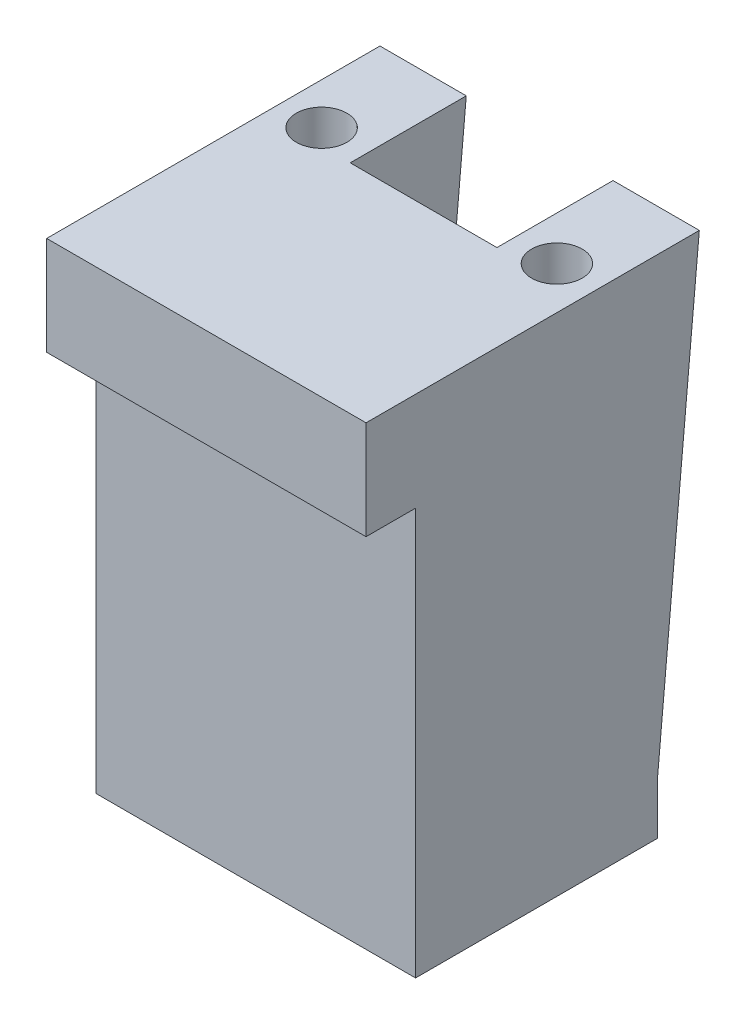
ISO-10303-21;
HEADER;
FILE_DESCRIPTION(('STEP AP214'),'2;1');
FILE_NAME('part.step','',(''),(''),'','','');
FILE_SCHEMA(('AUTOMOTIVE_DESIGN { 1 0 10303 214 1 1 1 1 }'));
ENDSEC;
DATA;
#1=APPLICATION_CONTEXT('core data for automotive mechanical design processes');
#2=APPLICATION_PROTOCOL_DEFINITION('international standard','automotive_design',2000,#1);
#3=PRODUCT_CONTEXT('',#1,'mechanical');
#4=PRODUCT('Part','Part','',(#3));
#5=PRODUCT_RELATED_PRODUCT_CATEGORY('part','',(#4));
#6=PRODUCT_DEFINITION_FORMATION('','',#4);
#7=PRODUCT_DEFINITION_CONTEXT('part definition',#1,'design');
#8=PRODUCT_DEFINITION('design','',#6,#7);
#9=PRODUCT_DEFINITION_SHAPE('','',#8);
#10=(LENGTH_UNIT() NAMED_UNIT(*) SI_UNIT(.MILLI.,.METRE.));
#11=(NAMED_UNIT(*) PLANE_ANGLE_UNIT() SI_UNIT($,.RADIAN.));
#12=(NAMED_UNIT(*) SI_UNIT($,.STERADIAN.) SOLID_ANGLE_UNIT());
#13=UNCERTAINTY_MEASURE_WITH_UNIT(LENGTH_MEASURE(1.E-05),#10,'distance_accuracy_value','');
#14=(GEOMETRIC_REPRESENTATION_CONTEXT(3) GLOBAL_UNCERTAINTY_ASSIGNED_CONTEXT((#13)) GLOBAL_UNIT_ASSIGNED_CONTEXT((#10,
#11,#12)) REPRESENTATION_CONTEXT('',''));
#15=CARTESIAN_POINT('',(0.,0.,0.));
#16=DIRECTION('',(0.,0.,1.));
#17=DIRECTION('',(1.,0.,0.));
#18=AXIS2_PLACEMENT_3D('',#15,#16,#17);
#19=CARTESIAN_POINT('',(9.55614021546639,122.000001788139,-106.221518242105));
#20=DIRECTION('',(0.,-1.,0.));
#21=DIRECTION('',(-1.,0.,0.));
#22=AXIS2_PLACEMENT_3D('',#19,#20,#21);
#23=CYLINDRICAL_SURFACE('',#22,2.05);
#24=CARTESIAN_POINT('',(9.55614021546639,122.000001788139,-106.221518242105));
#25=DIRECTION('',(0.,-1.,0.));
#26=DIRECTION('',(-1.,0.,0.));
#27=AXIS2_PLACEMENT_3D('',#24,#25,#26);
#28=CIRCLE('',#27,2.05);
#29=CARTESIAN_POINT('',(11.6061402154664,122.000001788139,-106.221518242105));
#30=VERTEX_POINT('',#29);
#31=EDGE_CURVE('E247',#30,#30,#28,.T.);
#32=ORIENTED_EDGE('',*,*,#31,.F.);
#33=DIRECTION('',(0.,-1.,0.));
#34=VECTOR('',#33,1.);
#35=CARTESIAN_POINT('',(11.6061402154664,122.000001788139,-106.221518242105));
#36=LINE('',#35,#34);
#37=CARTESIAN_POINT('',(11.6061402154664,111.000001788139,-106.221518242105));
#38=VERTEX_POINT('',#37);
#39=EDGE_CURVE('E11',#30,#38,#36,.T.);
#40=ORIENTED_EDGE('',*,*,#39,.T.);
#41=CARTESIAN_POINT('',(9.55614021546639,111.000001788139,-106.221518242105));
#42=DIRECTION('',(0.,-1.,0.));
#43=DIRECTION('',(-1.,0.,0.));
#44=AXIS2_PLACEMENT_3D('',#41,#42,#43);
#45=CIRCLE('',#44,2.05);
#46=EDGE_CURVE('E236',#38,#38,#45,.T.);
#47=ORIENTED_EDGE('',*,*,#46,.T.);
#48=ORIENTED_EDGE('',*,*,#39,.F.);
#49=EDGE_LOOP('',(#32,#40,#47,#48));
#50=FACE_BOUND('',#49,.T.);
#51=ADVANCED_FACE('F16',(#50),#23,.F.);
#52=CARTESIAN_POINT('',(-9.52534584156662,122.000001788139,-106.221518242105));
#53=DIRECTION('',(0.,-1.,0.));
#54=DIRECTION('',(-1.,0.,0.));
#55=AXIS2_PLACEMENT_3D('',#52,#53,#54);
#56=CYLINDRICAL_SURFACE('',#55,2.05);
#57=CARTESIAN_POINT('',(-9.52534584156662,122.000001788139,-106.221518242105));
#58=DIRECTION('',(0.,-1.,0.));
#59=DIRECTION('',(-1.,0.,0.));
#60=AXIS2_PLACEMENT_3D('',#57,#58,#59);
#61=CIRCLE('',#60,2.05);
#62=CARTESIAN_POINT('',(-7.47534584156661,122.000001788139,-106.221518242105));
#63=VERTEX_POINT('',#62);
#64=EDGE_CURVE('E251',#63,#63,#61,.T.);
#65=ORIENTED_EDGE('',*,*,#64,.F.);
#66=DIRECTION('',(0.,-1.,0.));
#67=VECTOR('',#66,1.);
#68=CARTESIAN_POINT('',(-7.47534584156661,122.000001788139,-106.221518242105));
#69=LINE('',#68,#67);
#70=CARTESIAN_POINT('',(-7.47534584156661,111.000001788139,-106.221518242105));
#71=VERTEX_POINT('',#70);
#72=EDGE_CURVE('E27',#63,#71,#69,.T.);
#73=ORIENTED_EDGE('',*,*,#72,.T.);
#74=CARTESIAN_POINT('',(-9.52534584156662,111.000001788139,-106.221518242105));
#75=DIRECTION('',(0.,-1.,0.));
#76=DIRECTION('',(-1.,0.,0.));
#77=AXIS2_PLACEMENT_3D('',#74,#75,#76);
#78=CIRCLE('',#77,2.05);
#79=EDGE_CURVE('E240',#71,#71,#78,.T.);
#80=ORIENTED_EDGE('',*,*,#79,.T.);
#81=ORIENTED_EDGE('',*,*,#72,.F.);
#82=EDGE_LOOP('',(#65,#73,#80,#81));
#83=FACE_BOUND('',#82,.T.);
#84=ADVANCED_FACE('F395',(#83),#56,.F.);
#85=CARTESIAN_POINT('',(13.0000001937151,142.,-149.000001152606));
#86=DIRECTION('',(1.,0.,0.));
#87=DIRECTION('',(0.,0.,-1.));
#88=AXIS2_PLACEMENT_3D('',#85,#86,#87);
#89=PLANE('',#88);
#90=DIRECTION('',(0.,0.995775852246426,-0.0918174933381671));
#91=VECTOR('',#90,1.);
#92=CARTESIAN_POINT('',(13.0000001937151,133.500726871943,-115.38831263984));
#93=LINE('',#92,#91);
#94=CARTESIAN_POINT('',(13.0000001937151,85.,-110.916206636852));
#95=VERTEX_POINT('',#94);
#96=CARTESIAN_POINT('',(13.0000001937151,122.000001788139,-114.32786540527));
#97=VERTEX_POINT('',#96);
#98=EDGE_CURVE('E239',#95,#97,#93,.T.);
#99=ORIENTED_EDGE('',*,*,#98,.T.);
#100=DIRECTION('',(0.,0.,-1.));
#101=VECTOR('',#100,1.);
#102=CARTESIAN_POINT('',(13.0000001937151,122.000001788139,-137.479052523667));
#103=LINE('',#102,#101);
#104=CARTESIAN_POINT('',(13.0000001937151,122.000001788139,-87.3002066368526));
#105=VERTEX_POINT('',#104);
#106=EDGE_CURVE('E197',#105,#97,#103,.T.);
#107=ORIENTED_EDGE('',*,*,#106,.F.);
#108=DIRECTION('',(0.,1.,0.));
#109=VECTOR('',#108,1.);
#110=CARTESIAN_POINT('',(13.0000001937151,142.,-87.3002066368526));
#111=LINE('',#110,#109);
#112=CARTESIAN_POINT('',(13.0000001937151,114.,-87.3002066368525));
#113=VERTEX_POINT('',#112);
#114=EDGE_CURVE('E148',#113,#105,#111,.T.);
#115=ORIENTED_EDGE('',*,*,#114,.F.);
#116=DIRECTION('',(0.,0.,1.));
#117=VECTOR('',#116,1.);
#118=CARTESIAN_POINT('',(13.0000001937151,114.,-102.916206636852));
#119=LINE('',#118,#117);
#120=CARTESIAN_POINT('',(13.0000001937151,114.,-91.3162066368525));
#121=VERTEX_POINT('',#120);
#122=EDGE_CURVE('E253',#121,#113,#119,.T.);
#123=ORIENTED_EDGE('',*,*,#122,.F.);
#124=DIRECTION('',(0.,1.,0.));
#125=VECTOR('',#124,1.);
#126=CARTESIAN_POINT('',(13.0000001937151,85.,-91.3162066368525));
#127=LINE('',#126,#125);
#128=CARTESIAN_POINT('',(13.0000001937151,81.,-91.3162066368525));
#129=VERTEX_POINT('',#128);
#130=EDGE_CURVE('E258',#129,#121,#127,.T.);
#131=ORIENTED_EDGE('',*,*,#130,.F.);
#132=DIRECTION('',(0.,0.,1.));
#133=VECTOR('',#132,1.);
#134=CARTESIAN_POINT('',(13.0000001937151,81.,-105.916206636852));
#135=LINE('',#134,#133);
#136=CARTESIAN_POINT('',(13.0000001937151,81.,-110.916206636852));
#137=VERTEX_POINT('',#136);
#138=EDGE_CURVE('E234',#137,#129,#135,.T.);
#139=ORIENTED_EDGE('',*,*,#138,.F.);
#140=DIRECTION('',(0.,-1.,0.));
#141=VECTOR('',#140,1.);
#142=CARTESIAN_POINT('',(13.0000001937151,85.,-110.916206636852));
#143=LINE('',#142,#141);
#144=EDGE_CURVE('E265',#95,#137,#143,.T.);
#145=ORIENTED_EDGE('',*,*,#144,.F.);
#146=EDGE_LOOP('',(#99,#107,#115,#123,#131,#139,#145));
#147=FACE_BOUND('',#146,.T.);
#148=ADVANCED_FACE('F336',(#147),#89,.T.);
#149=CARTESIAN_POINT('',(-12.8999816751176,142.,-102.916206636853));
#150=DIRECTION('',(-1.,0.,0.));
#151=DIRECTION('',(0.,1.,0.));
#152=AXIS2_PLACEMENT_3D('',#149,#150,#151);
#153=PLANE('',#152);
#154=DIRECTION('',(0.,-0.995775852246426,0.0918174933381671));
#155=VECTOR('',#154,1.);
#156=CARTESIAN_POINT('',(-12.8999816751176,131.394014438987,-115.194059029108));
#157=LINE('',#156,#155);
#158=CARTESIAN_POINT('',(-12.8999816751176,122.000001788139,-114.32786540527));
#159=VERTEX_POINT('',#158);
#160=CARTESIAN_POINT('',(-12.8999816751176,85.,-110.916206636852));
#161=VERTEX_POINT('',#160);
#162=EDGE_CURVE('E224',#159,#161,#157,.T.);
#163=ORIENTED_EDGE('',*,*,#162,.T.);
#164=DIRECTION('',(0.,-1.,0.));
#165=VECTOR('',#164,1.);
#166=CARTESIAN_POINT('',(-12.8999816751176,85.,-110.916206636852));
#167=LINE('',#166,#165);
#168=CARTESIAN_POINT('',(-12.8999816751176,81.,-110.916206636852));
#169=VERTEX_POINT('',#168);
#170=EDGE_CURVE('E146',#161,#169,#167,.T.);
#171=ORIENTED_EDGE('',*,*,#170,.T.);
#172=DIRECTION('',(0.,0.,1.));
#173=VECTOR('',#172,1.);
#174=CARTESIAN_POINT('',(-12.8999816751176,81.,-100.316206636852));
#175=LINE('',#174,#173);
#176=CARTESIAN_POINT('',(-12.8999816751176,81.,-91.3162066368525));
#177=VERTEX_POINT('',#176);
#178=EDGE_CURVE('E243',#169,#177,#175,.T.);
#179=ORIENTED_EDGE('',*,*,#178,.T.);
#180=DIRECTION('',(0.,-1.,0.));
#181=VECTOR('',#180,1.);
#182=CARTESIAN_POINT('',(-12.8999816751176,137.,-91.3162066368525));
#183=LINE('',#182,#181);
#184=CARTESIAN_POINT('',(-12.8999816751176,114.,-91.3162066368525));
#185=VERTEX_POINT('',#184);
#186=EDGE_CURVE('E229',#185,#177,#183,.T.);
#187=ORIENTED_EDGE('',*,*,#186,.F.);
#188=DIRECTION('',(0.,0.,1.));
#189=VECTOR('',#188,1.);
#190=CARTESIAN_POINT('',(-12.8999816751176,114.,-102.916206636852));
#191=LINE('',#190,#189);
#192=CARTESIAN_POINT('',(-12.8999816751176,114.,-87.3002066368525));
#193=VERTEX_POINT('',#192);
#194=EDGE_CURVE('E293',#185,#193,#191,.T.);
#195=ORIENTED_EDGE('',*,*,#194,.T.);
#196=DIRECTION('',(0.,-1.,0.));
#197=VECTOR('',#196,1.);
#198=CARTESIAN_POINT('',(-12.8999816751176,142.,-87.3002066368526));
#199=LINE('',#198,#197);
#200=CARTESIAN_POINT('',(-12.8999816751176,122.000001788139,-87.3002066368526));
#201=VERTEX_POINT('',#200);
#202=EDGE_CURVE('E155',#201,#193,#199,.T.);
#203=ORIENTED_EDGE('',*,*,#202,.F.);
#204=DIRECTION('',(0.,0.,1.));
#205=VECTOR('',#204,1.);
#206=CARTESIAN_POINT('',(-12.8999816751176,122.000001788139,-114.437155265791));
#207=LINE('',#206,#205);
#208=EDGE_CURVE('E190',#159,#201,#207,.T.);
#209=ORIENTED_EDGE('',*,*,#208,.F.);
#210=EDGE_LOOP('',(#163,#171,#179,#187,#195,#203,#209));
#211=FACE_BOUND('',#210,.T.);
#212=ADVANCED_FACE('F327',(#211),#153,.T.);
#213=CARTESIAN_POINT('',(-12.8999816751176,122.000001788139,-114.32786540527));
#214=DIRECTION('',(0.,0.0918174933381671,0.995775852246426));
#215=DIRECTION('',(1.,0.,0.));
#216=AXIS2_PLACEMENT_3D('',#213,#214,#215);
#217=PLANE('',#216);
#218=DIRECTION('',(1.,0.,0.));
#219=VECTOR('',#218,1.);
#220=CARTESIAN_POINT('',(-6.89998167511758,85.,-110.916206636852));
#221=LINE('',#220,#219);
#222=CARTESIAN_POINT('',(-5.89998167511758,84.9999999999955,-110.916206636852));
#223=VERTEX_POINT('',#222);
#224=EDGE_CURVE('E122',#161,#223,#221,.T.);
#225=ORIENTED_EDGE('',*,*,#224,.F.);
#226=ORIENTED_EDGE('',*,*,#162,.F.);
#227=DIRECTION('',(1.,0.,0.));
#228=VECTOR('',#227,1.);
#229=CARTESIAN_POINT('',(-6.90000008940697,122.000001788139,-114.32786540527));
#230=LINE('',#229,#228);
#231=CARTESIAN_POINT('',(-5.89998167511758,122.000001788139,-114.32786540527));
#232=VERTEX_POINT('',#231);
#233=EDGE_CURVE('E124',#159,#232,#230,.T.);
#234=ORIENTED_EDGE('',*,*,#233,.T.);
#235=DIRECTION('',(0.,0.995775852246426,-0.0918174933381668));
#236=VECTOR('',#235,1.);
#237=CARTESIAN_POINT('',(-5.89998167511758,85.0000000000004,-110.916206636853));
#238=LINE('',#237,#236);
#239=EDGE_CURVE('E20',#223,#232,#238,.T.);
#240=ORIENTED_EDGE('',*,*,#239,.F.);
#241=EDGE_LOOP('',(#225,#226,#234,#240));
#242=FACE_BOUND('',#241,.T.);
#243=ADVANCED_FACE('F120',(#242),#217,.F.);
#244=CARTESIAN_POINT('',(-12.8999816751176,122.000001788139,-114.32786540527));
#245=DIRECTION('',(0.,0.0918174933381671,0.995775852246426));
#246=DIRECTION('',(1.,0.,0.));
#247=AXIS2_PLACEMENT_3D('',#244,#245,#246);
#248=PLANE('',#247);
#249=DIRECTION('',(-1.,0.,0.));
#250=VECTOR('',#249,1.);
#251=CARTESIAN_POINT('',(7.00001832488242,122.000001788139,-114.32786540527));
#252=LINE('',#251,#250);
#253=CARTESIAN_POINT('',(6.00001832488242,122.000001788139,-114.32786540527));
#254=VERTEX_POINT('',#253);
#255=EDGE_CURVE('E252',#97,#254,#252,.T.);
#256=ORIENTED_EDGE('',*,*,#255,.F.);
#257=ORIENTED_EDGE('',*,*,#98,.F.);
#258=DIRECTION('',(1.,0.,0.));
#259=VECTOR('',#258,1.);
#260=CARTESIAN_POINT('',(13.0000001937151,85.,-110.916206636852));
#261=LINE('',#260,#259);
#262=CARTESIAN_POINT('',(6.00001832488242,85.,-110.916206636852));
#263=VERTEX_POINT('',#262);
#264=EDGE_CURVE('E217',#263,#95,#261,.T.);
#265=ORIENTED_EDGE('',*,*,#264,.F.);
#266=DIRECTION('',(0.,-0.995775852246426,0.0918174933381671));
#267=VECTOR('',#266,1.);
#268=CARTESIAN_POINT('',(6.00001832488242,121.543351970749,-114.285759100451));
#269=LINE('',#268,#267);
#270=EDGE_CURVE('E173',#254,#263,#269,.T.);
#271=ORIENTED_EDGE('',*,*,#270,.F.);
#272=EDGE_LOOP('',(#256,#257,#265,#271));
#273=FACE_BOUND('',#272,.T.);
#274=ADVANCED_FACE('F18',(#273),#248,.F.);
#275=CARTESIAN_POINT('',(9.55614021546639,111.000001788139,-106.221518242105));
#276=DIRECTION('',(0.,1.,0.));
#277=DIRECTION('',(1.,0.,0.));
#278=AXIS2_PLACEMENT_3D('',#275,#276,#277);
#279=PLANE('',#278);
#280=ORIENTED_EDGE('',*,*,#46,.F.);
#281=EDGE_LOOP('',(#280));
#282=FACE_BOUND('',#281,.T.);
#283=ADVANCED_FACE('F384',(#282),#279,.T.);
#284=CARTESIAN_POINT('',(-9.52534584156662,111.000001788139,-106.221518242105));
#285=DIRECTION('',(0.,1.,0.));
#286=DIRECTION('',(1.,0.,0.));
#287=AXIS2_PLACEMENT_3D('',#284,#285,#286);
#288=PLANE('',#287);
#289=ORIENTED_EDGE('',*,*,#79,.F.);
#290=EDGE_LOOP('',(#289));
#291=FACE_BOUND('',#290,.T.);
#292=ADVANCED_FACE('F390',(#291),#288,.T.);
#293=CARTESIAN_POINT('',(6.00000007450581,122.000001788139,-86.));
#294=DIRECTION('',(0.,-1.,0.));
#295=DIRECTION('',(0.,0.,-1.));
#296=AXIS2_PLACEMENT_3D('',#293,#294,#295);
#297=PLANE('',#296);
#298=ORIENTED_EDGE('',*,*,#64,.T.);
#299=EDGE_LOOP('',(#298));
#300=FACE_BOUND('',#299,.T.);
#301=ORIENTED_EDGE('',*,*,#31,.T.);
#302=EDGE_LOOP('',(#301));
#303=FACE_BOUND('',#302,.T.);
#304=DIRECTION('',(-1.,0.,0.));
#305=VECTOR('',#304,1.);
#306=CARTESIAN_POINT('',(-3.44999080030589,122.000001788139,-104.916206636853));
#307=LINE('',#306,#305);
#308=CARTESIAN_POINT('',(6.00000007450581,122.000001788139,-104.916206636853));
#309=VERTEX_POINT('',#308);
#310=CARTESIAN_POINT('',(-5.90000008940697,122.000001788139,-104.916206636853));
#311=VERTEX_POINT('',#310);
#312=EDGE_CURVE('E159',#309,#311,#307,.T.);
#313=ORIENTED_EDGE('',*,*,#312,.T.);
#314=DIRECTION('',(0.,0.,1.));
#315=VECTOR('',#314,1.);
#316=CARTESIAN_POINT('',(-5.89998167511758,122.000001788139,-98.4581033184263));
#317=LINE('',#316,#315);
#318=CARTESIAN_POINT('',(-5.89998167511758,122.000001788139,-110.916206636853));
#319=VERTEX_POINT('',#318);
#320=EDGE_CURVE('E182',#319,#311,#317,.T.);
#321=ORIENTED_EDGE('',*,*,#320,.F.);
#322=DIRECTION('',(0.,0.,1.));
#323=VECTOR('',#322,1.);
#324=CARTESIAN_POINT('',(-5.89998167511758,122.000001788139,-110.916206636853));
#325=LINE('',#324,#323);
#326=EDGE_CURVE('E128',#232,#319,#325,.T.);
#327=ORIENTED_EDGE('',*,*,#326,.F.);
#328=ORIENTED_EDGE('',*,*,#233,.F.);
#329=ORIENTED_EDGE('',*,*,#208,.T.);
#330=DIRECTION('',(-1.,0.,0.));
#331=VECTOR('',#330,1.);
#332=CARTESIAN_POINT('',(6.52501168851824,122.000001788139,-87.3002066368525));
#333=LINE('',#332,#331);
#334=EDGE_CURVE('E286',#105,#201,#333,.T.);
#335=ORIENTED_EDGE('',*,*,#334,.F.);
#336=ORIENTED_EDGE('',*,*,#106,.T.);
#337=ORIENTED_EDGE('',*,*,#255,.T.);
#338=DIRECTION('',(0.,0.,-1.));
#339=VECTOR('',#338,1.);
#340=CARTESIAN_POINT('',(6.00001832488242,122.000001788139,-100.591975971241));
#341=LINE('',#340,#339);
#342=CARTESIAN_POINT('',(6.00000007450581,122.000001788139,-110.916206636853));
#343=VERTEX_POINT('',#342);
#344=EDGE_CURVE('E191',#343,#254,#341,.T.);
#345=ORIENTED_EDGE('',*,*,#344,.F.);
#346=DIRECTION('',(0.,0.,-1.));
#347=VECTOR('',#346,1.);
#348=CARTESIAN_POINT('',(6.00001832488242,122.000001788139,-100.591975971241));
#349=LINE('',#348,#347);
#350=EDGE_CURVE('E200',#309,#343,#349,.T.);
#351=ORIENTED_EDGE('',*,*,#350,.F.);
#352=EDGE_LOOP('',(#313,#321,#327,#328,#329,#335,#336,#337,#345,#351));
#353=FACE_BOUND('',#352,.T.);
#354=ADVANCED_FACE('F324',(#300,#303,#353),#297,.F.);
#355=CARTESIAN_POINT('',(6.00001832488242,121.,-115.183951942483));
#356=DIRECTION('',(-1.,0.,0.));
#357=DIRECTION('',(0.,0.,1.));
#358=AXIS2_PLACEMENT_3D('',#355,#356,#357);
#359=PLANE('',#358);
#360=ORIENTED_EDGE('',*,*,#270,.T.);
#361=DIRECTION('',(0.,-1.,0.));
#362=VECTOR('',#361,1.);
#363=CARTESIAN_POINT('',(6.00001832488242,85.,-110.916206636852));
#364=LINE('',#363,#362);
#365=CARTESIAN_POINT('',(6.00001832488242,81.,-110.916206636852));
#366=VERTEX_POINT('',#365);
#367=EDGE_CURVE('E230',#263,#366,#364,.T.);
#368=ORIENTED_EDGE('',*,*,#367,.T.);
#369=DIRECTION('',(0.,0.,-1.));
#370=VECTOR('',#369,1.);
#371=CARTESIAN_POINT('',(6.00001832488242,81.,-111.800079289667));
#372=LINE('',#371,#370);
#373=CARTESIAN_POINT('',(6.00001832488242,81.,-104.916206636852));
#374=VERTEX_POINT('',#373);
#375=EDGE_CURVE('E187',#374,#366,#372,.T.);
#376=ORIENTED_EDGE('',*,*,#375,.F.);
#377=DIRECTION('',(0.,-1.,0.));
#378=VECTOR('',#377,1.);
#379=CARTESIAN_POINT('',(6.00001832488242,129.,-104.916206636853));
#380=LINE('',#379,#378);
#381=EDGE_CURVE('E164',#309,#374,#380,.T.);
#382=ORIENTED_EDGE('',*,*,#381,.F.);
#383=ORIENTED_EDGE('',*,*,#350,.T.);
#384=ORIENTED_EDGE('',*,*,#344,.T.);
#385=EDGE_LOOP('',(#360,#368,#376,#382,#383,#384));
#386=FACE_BOUND('',#385,.T.);
#387=ADVANCED_FACE('F378',(#386),#359,.T.);
#388=CARTESIAN_POINT('',(-12.8999816751176,137.,-104.916206636853));
#389=DIRECTION('',(0.,0.,1.));
#390=DIRECTION('',(1.,0.,0.));
#391=AXIS2_PLACEMENT_3D('',#388,#389,#390);
#392=PLANE('',#391);
#393=DIRECTION('',(0.,1.,0.));
#394=VECTOR('',#393,1.);
#395=CARTESIAN_POINT('',(-5.89998167511758,129.50000089407,-104.916206636853));
#396=LINE('',#395,#394);
#397=CARTESIAN_POINT('',(-5.89998167511758,81.,-104.916206636852));
#398=VERTEX_POINT('',#397);
#399=EDGE_CURVE('E129',#398,#311,#396,.T.);
#400=ORIENTED_EDGE('',*,*,#399,.T.);
#401=ORIENTED_EDGE('',*,*,#312,.F.);
#402=ORIENTED_EDGE('',*,*,#381,.T.);
#403=DIRECTION('',(1.,0.,0.));
#404=VECTOR('',#403,1.);
#405=CARTESIAN_POINT('',(3.02501379209059,81.,-104.916206636853));
#406=LINE('',#405,#404);
#407=EDGE_CURVE('E218',#398,#374,#406,.T.);
#408=ORIENTED_EDGE('',*,*,#407,.F.);
#409=EDGE_LOOP('',(#400,#401,#402,#408));
#410=FACE_BOUND('',#409,.T.);
#411=ADVANCED_FACE('F406',(#410),#392,.F.);
#412=CARTESIAN_POINT('',(-5.89998167511758,122.000001788139,-110.916206636853));
#413=DIRECTION('',(1.,0.,0.));
#414=DIRECTION('',(0.,1.,0.));
#415=AXIS2_PLACEMENT_3D('',#412,#413,#414);
#416=PLANE('',#415);
#417=ORIENTED_EDGE('',*,*,#320,.T.);
#418=ORIENTED_EDGE('',*,*,#399,.F.);
#419=DIRECTION('',(0.,0.,1.));
#420=VECTOR('',#419,1.);
#421=CARTESIAN_POINT('',(-5.89998167511758,81.,-109.666206636853));
#422=LINE('',#421,#420);
#423=CARTESIAN_POINT('',(-5.89998167511758,81.,-110.916206636852));
#424=VERTEX_POINT('',#423);
#425=EDGE_CURVE('E136',#424,#398,#422,.T.);
#426=ORIENTED_EDGE('',*,*,#425,.F.);
#427=DIRECTION('',(0.,-1.,0.));
#428=VECTOR('',#427,1.);
#429=CARTESIAN_POINT('',(-5.89998167511758,85.,-110.916206636852));
#430=LINE('',#429,#428);
#431=EDGE_CURVE('E131',#223,#424,#430,.T.);
#432=ORIENTED_EDGE('',*,*,#431,.F.);
#433=ORIENTED_EDGE('',*,*,#239,.T.);
#434=ORIENTED_EDGE('',*,*,#326,.T.);
#435=EDGE_LOOP('',(#417,#418,#426,#432,#433,#434));
#436=FACE_BOUND('',#435,.T.);
#437=ADVANCED_FACE('F133',(#436),#416,.T.);
#438=CARTESIAN_POINT('',(0.0500092592987578,81.,-108.416206636852));
#439=DIRECTION('',(0.,-1.,0.));
#440=DIRECTION('',(0.,0.,-1.));
#441=AXIS2_PLACEMENT_3D('',#438,#439,#440);
#442=PLANE('',#441);
#443=DIRECTION('',(1.,0.,0.));
#444=VECTOR('',#443,1.);
#445=CARTESIAN_POINT('',(13.0000001937151,81.,-110.916206636852));
#446=LINE('',#445,#444);
#447=EDGE_CURVE('E235',#366,#137,#446,.T.);
#448=ORIENTED_EDGE('',*,*,#447,.T.);
#449=ORIENTED_EDGE('',*,*,#138,.T.);
#450=DIRECTION('',(1.,0.,0.));
#451=VECTOR('',#450,1.);
#452=CARTESIAN_POINT('',(-12.8999816751176,81.,-91.3162066368525));
#453=LINE('',#452,#451);
#454=EDGE_CURVE('E272',#177,#129,#453,.T.);
#455=ORIENTED_EDGE('',*,*,#454,.F.);
#456=ORIENTED_EDGE('',*,*,#178,.F.);
#457=DIRECTION('',(1.,0.,0.));
#458=VECTOR('',#457,1.);
#459=CARTESIAN_POINT('',(-6.89998167511758,81.,-110.916206636852));
#460=LINE('',#459,#458);
#461=EDGE_CURVE('E141',#169,#424,#460,.T.);
#462=ORIENTED_EDGE('',*,*,#461,.T.);
#463=ORIENTED_EDGE('',*,*,#425,.T.);
#464=ORIENTED_EDGE('',*,*,#407,.T.);
#465=ORIENTED_EDGE('',*,*,#375,.T.);
#466=EDGE_LOOP('',(#448,#449,#455,#456,#462,#463,#464,#465));
#467=FACE_BOUND('',#466,.T.);
#468=ADVANCED_FACE('F347',(#467),#442,.T.);
#469=CARTESIAN_POINT('',(6.00001832488242,85.,-110.916206636852));
#470=DIRECTION('',(0.,0.,-1.));
#471=DIRECTION('',(0.,-1.,0.));
#472=AXIS2_PLACEMENT_3D('',#469,#470,#471);
#473=PLANE('',#472);
#474=ORIENTED_EDGE('',*,*,#264,.T.);
#475=ORIENTED_EDGE('',*,*,#144,.T.);
#476=ORIENTED_EDGE('',*,*,#447,.F.);
#477=ORIENTED_EDGE('',*,*,#367,.F.);
#478=EDGE_LOOP('',(#474,#475,#476,#477));
#479=FACE_BOUND('',#478,.T.);
#480=ADVANCED_FACE('F382',(#479),#473,.T.);
#481=CARTESIAN_POINT('',(-12.8999816751176,85.,-110.916206636852));
#482=DIRECTION('',(0.,0.,-1.));
#483=DIRECTION('',(0.,-1.,0.));
#484=AXIS2_PLACEMENT_3D('',#481,#482,#483);
#485=PLANE('',#484);
#486=ORIENTED_EDGE('',*,*,#224,.T.);
#487=ORIENTED_EDGE('',*,*,#431,.T.);
#488=ORIENTED_EDGE('',*,*,#461,.F.);
#489=ORIENTED_EDGE('',*,*,#170,.F.);
#490=EDGE_LOOP('',(#486,#487,#488,#489));
#491=FACE_BOUND('',#490,.T.);
#492=ADVANCED_FACE('F144',(#491),#485,.T.);
#493=CARTESIAN_POINT('',(13.0000001937151,142.,-87.3002066368526));
#494=DIRECTION('',(0.,0.,1.));
#495=DIRECTION('',(1.,0.,0.));
#496=AXIS2_PLACEMENT_3D('',#493,#494,#495);
#497=PLANE('',#496);
#498=ORIENTED_EDGE('',*,*,#334,.T.);
#499=ORIENTED_EDGE('',*,*,#202,.T.);
#500=DIRECTION('',(1.,0.,0.));
#501=VECTOR('',#500,1.);
#502=CARTESIAN_POINT('',(-12.8999816751176,114.,-87.3002066368525));
#503=LINE('',#502,#501);
#504=EDGE_CURVE('E257',#193,#113,#503,.T.);
#505=ORIENTED_EDGE('',*,*,#504,.T.);
#506=ORIENTED_EDGE('',*,*,#114,.T.);
#507=EDGE_LOOP('',(#498,#499,#505,#506));
#508=FACE_BOUND('',#507,.T.);
#509=ADVANCED_FACE('F321',(#508),#497,.T.);
#510=CARTESIAN_POINT('',(0.0500092592987578,114.,-125.958103894729));
#511=DIRECTION('',(0.,-1.,0.));
#512=DIRECTION('',(-1.,0.,0.));
#513=AXIS2_PLACEMENT_3D('',#510,#511,#512);
#514=PLANE('',#513);
#515=DIRECTION('',(1.,0.,0.));
#516=VECTOR('',#515,1.);
#517=CARTESIAN_POINT('',(6.52500472650693,114.,-91.3162066368525));
#518=LINE('',#517,#516);
#519=EDGE_CURVE('E225',#185,#121,#518,.T.);
#520=ORIENTED_EDGE('',*,*,#519,.T.);
#521=ORIENTED_EDGE('',*,*,#122,.T.);
#522=ORIENTED_EDGE('',*,*,#504,.F.);
#523=ORIENTED_EDGE('',*,*,#194,.F.);
#524=EDGE_LOOP('',(#520,#521,#522,#523));
#525=FACE_BOUND('',#524,.T.);
#526=ADVANCED_FACE('F332',(#525),#514,.T.);
#527=CARTESIAN_POINT('',(13.0000001937151,137.,-91.3162066368525));
#528=DIRECTION('',(0.,0.,1.));
#529=DIRECTION('',(1.,0.,0.));
#530=AXIS2_PLACEMENT_3D('',#527,#528,#529);
#531=PLANE('',#530);
#532=ORIENTED_EDGE('',*,*,#519,.F.);
#533=ORIENTED_EDGE('',*,*,#186,.T.);
#534=ORIENTED_EDGE('',*,*,#454,.T.);
#535=ORIENTED_EDGE('',*,*,#130,.T.);
#536=EDGE_LOOP('',(#532,#533,#534,#535));
#537=FACE_BOUND('',#536,.T.);
#538=ADVANCED_FACE('F342',(#537),#531,.T.);
#539=CLOSED_SHELL('',(#51,#84,#148,#212,#243,#274,#283,#292,#354,#387,#411,#437,#468,#480,#492,
#509,#526,#538));
#540=MANIFOLD_SOLID_BREP('B1',#539);
#541=ADVANCED_BREP_SHAPE_REPRESENTATION('',(#18,#540),#14);
#542=SHAPE_DEFINITION_REPRESENTATION(#9,#541);
ENDSEC;
END-ISO-10303-21;
